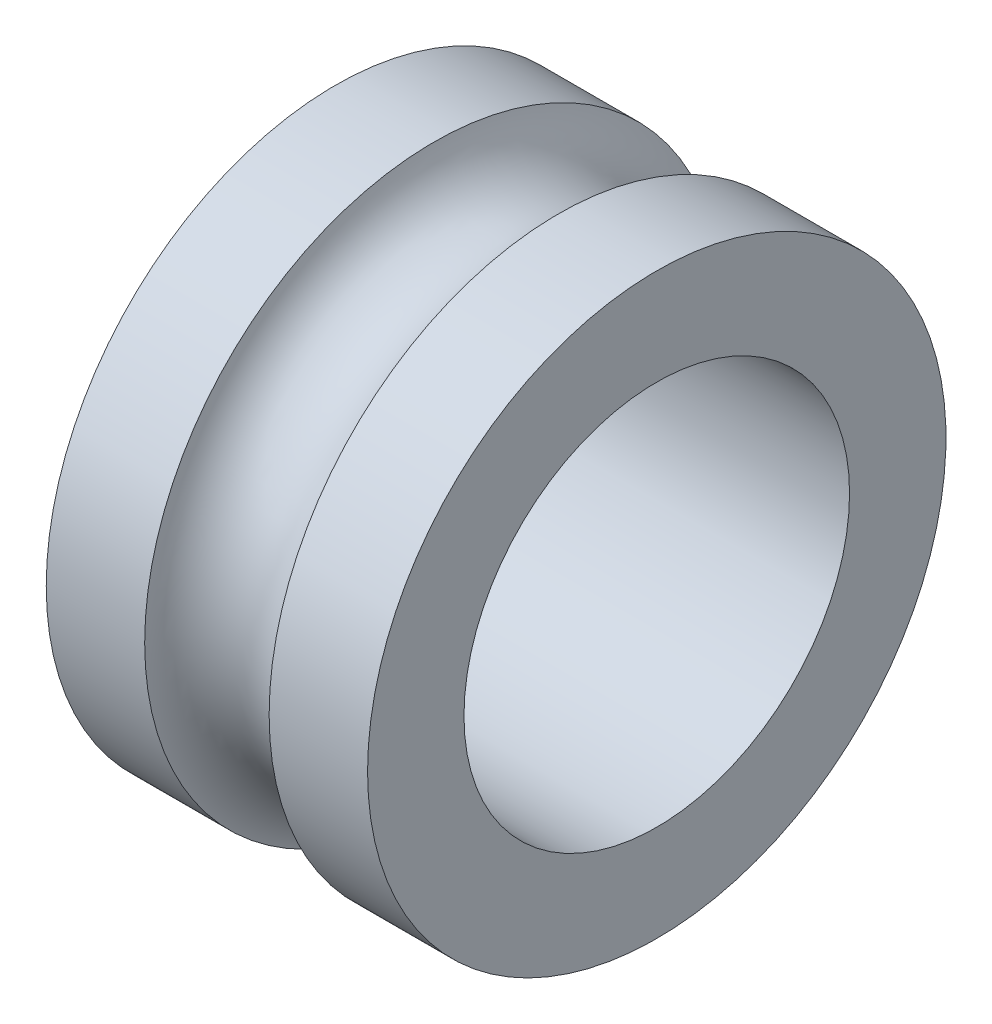
ISO-10303-21;
HEADER;
FILE_DESCRIPTION(('STEP AP214'),'2;1');
FILE_NAME('part.step','',(''),(''),'','','');
FILE_SCHEMA(('AUTOMOTIVE_DESIGN { 1 0 10303 214 1 1 1 1 }'));
ENDSEC;
DATA;
#1=APPLICATION_CONTEXT('core data for automotive mechanical design processes');
#2=APPLICATION_PROTOCOL_DEFINITION('international standard','automotive_design',2000,#1);
#3=PRODUCT_CONTEXT('',#1,'mechanical');
#4=PRODUCT('Part','Part','',(#3));
#5=PRODUCT_RELATED_PRODUCT_CATEGORY('part','',(#4));
#6=PRODUCT_DEFINITION_FORMATION('','',#4);
#7=PRODUCT_DEFINITION_CONTEXT('part definition',#1,'design');
#8=PRODUCT_DEFINITION('design','',#6,#7);
#9=PRODUCT_DEFINITION_SHAPE('','',#8);
#10=(LENGTH_UNIT() NAMED_UNIT(*) SI_UNIT(.MILLI.,.METRE.));
#11=(NAMED_UNIT(*) PLANE_ANGLE_UNIT() SI_UNIT($,.RADIAN.));
#12=(NAMED_UNIT(*) SI_UNIT($,.STERADIAN.) SOLID_ANGLE_UNIT());
#13=UNCERTAINTY_MEASURE_WITH_UNIT(LENGTH_MEASURE(1.E-05),#10,'distance_accuracy_value','');
#14=(GEOMETRIC_REPRESENTATION_CONTEXT(3) GLOBAL_UNCERTAINTY_ASSIGNED_CONTEXT((#13)) GLOBAL_UNIT_ASSIGNED_CONTEXT((#10,
#11,#12)) REPRESENTATION_CONTEXT('',''));
#15=CARTESIAN_POINT('',(0.,0.,0.));
#16=DIRECTION('',(0.,0.,1.));
#17=DIRECTION('',(1.,0.,0.));
#18=AXIS2_PLACEMENT_3D('',#15,#16,#17);
#19=CARTESIAN_POINT('',(-27.4434685173137,-8.792635278647,0.));
#20=DIRECTION('',(-1.,0.,0.));
#21=DIRECTION('',(0.,0.,1.));
#22=AXIS2_PLACEMENT_3D('',#19,#20,#21);
#23=CYLINDRICAL_SURFACE('',#22,4.5);
#24=CARTESIAN_POINT('',(-29.9434685173137,-8.792635278647,0.));
#25=DIRECTION('',(-1.,0.,0.));
#26=DIRECTION('',(0.,0.,1.));
#27=AXIS2_PLACEMENT_3D('',#24,#25,#26);
#28=CIRCLE('',#27,4.5);
#29=CARTESIAN_POINT('',(-29.9434685173137,-8.792635278647,4.5));
#30=VERTEX_POINT('',#29);
#31=EDGE_CURVE('E10',#30,#30,#28,.T.);
#32=ORIENTED_EDGE('',*,*,#31,.F.);
#33=EDGE_LOOP('',(#32));
#34=FACE_BOUND('',#33,.T.);
#35=CARTESIAN_POINT('',(-28.4117143538655,-8.792635278647,0.));
#36=DIRECTION('',(-1.,0.,0.));
#37=DIRECTION('',(0.,0.,1.));
#38=AXIS2_PLACEMENT_3D('',#35,#36,#37);
#39=CIRCLE('',#38,4.5);
#40=CARTESIAN_POINT('',(-28.4117143538655,-8.792635278647,4.5));
#41=VERTEX_POINT('',#40);
#42=EDGE_CURVE('E53',#41,#41,#39,.T.);
#43=ORIENTED_EDGE('',*,*,#42,.T.);
#44=EDGE_LOOP('',(#43));
#45=FACE_BOUND('',#44,.T.);
#46=ADVANCED_FACE('F31',(#34,#45),#23,.T.);
#47=CARTESIAN_POINT('',(-29.9434685173137,-4.292635278647,0.));
#48=DIRECTION('',(1.,0.,0.));
#49=DIRECTION('',(0.,0.,-1.));
#50=AXIS2_PLACEMENT_3D('',#47,#48,#49);
#51=PLANE('',#50);
#52=CARTESIAN_POINT('',(-29.9434685173137,-8.792635278647,0.));
#53=DIRECTION('',(-1.,0.,0.));
#54=DIRECTION('',(0.,0.,1.));
#55=AXIS2_PLACEMENT_3D('',#52,#53,#54);
#56=CIRCLE('',#55,3.);
#57=CARTESIAN_POINT('',(-29.9434685173137,-8.792635278647,3.));
#58=VERTEX_POINT('',#57);
#59=EDGE_CURVE('E37',#58,#58,#56,.T.);
#60=ORIENTED_EDGE('',*,*,#59,.F.);
#61=EDGE_LOOP('',(#60));
#62=FACE_BOUND('',#61,.T.);
#63=ORIENTED_EDGE('',*,*,#31,.T.);
#64=EDGE_LOOP('',(#63));
#65=FACE_BOUND('',#64,.T.);
#66=ADVANCED_FACE('F78',(#62,#65),#51,.F.);
#67=CARTESIAN_POINT('',(-27.4434685173137,-8.792635278647,0.));
#68=DIRECTION('',(-1.,0.,0.));
#69=DIRECTION('',(0.,0.,1.));
#70=AXIS2_PLACEMENT_3D('',#67,#68,#69);
#71=CYLINDRICAL_SURFACE('',#70,3.);
#72=CARTESIAN_POINT('',(-24.9434685173137,-8.792635278647,0.));
#73=DIRECTION('',(-1.,0.,0.));
#74=DIRECTION('',(0.,0.,1.));
#75=AXIS2_PLACEMENT_3D('',#72,#73,#74);
#76=CIRCLE('',#75,3.);
#77=CARTESIAN_POINT('',(-24.9434685173137,-8.792635278647,3.));
#78=VERTEX_POINT('',#77);
#79=EDGE_CURVE('E41',#78,#78,#76,.T.);
#80=ORIENTED_EDGE('',*,*,#79,.F.);
#81=EDGE_LOOP('',(#80));
#82=FACE_BOUND('',#81,.T.);
#83=ORIENTED_EDGE('',*,*,#59,.T.);
#84=EDGE_LOOP('',(#83));
#85=FACE_BOUND('',#84,.T.);
#86=ADVANCED_FACE('F73',(#82,#85),#71,.F.);
#87=CARTESIAN_POINT('',(-24.9434685173137,-4.292635278647,0.));
#88=DIRECTION('',(-1.,0.,0.));
#89=DIRECTION('',(0.,0.,1.));
#90=AXIS2_PLACEMENT_3D('',#87,#88,#89);
#91=PLANE('',#90);
#92=CARTESIAN_POINT('',(-24.9434685173137,-8.792635278647,0.));
#93=DIRECTION('',(-1.,0.,0.));
#94=DIRECTION('',(0.,0.,1.));
#95=AXIS2_PLACEMENT_3D('',#92,#93,#94);
#96=CIRCLE('',#95,4.5);
#97=CARTESIAN_POINT('',(-24.9434685173137,-8.792635278647,4.5));
#98=VERTEX_POINT('',#97);
#99=EDGE_CURVE('E45',#98,#98,#96,.T.);
#100=ORIENTED_EDGE('',*,*,#99,.F.);
#101=EDGE_LOOP('',(#100));
#102=FACE_BOUND('',#101,.T.);
#103=ORIENTED_EDGE('',*,*,#79,.T.);
#104=EDGE_LOOP('',(#103));
#105=FACE_BOUND('',#104,.T.);
#106=ADVANCED_FACE('F67',(#102,#105),#91,.F.);
#107=CARTESIAN_POINT('',(-27.4434685173137,-8.792635278647,0.));
#108=DIRECTION('',(-1.,0.,0.));
#109=DIRECTION('',(0.,0.,1.));
#110=AXIS2_PLACEMENT_3D('',#107,#108,#109);
#111=CYLINDRICAL_SURFACE('',#110,4.5);
#112=CARTESIAN_POINT('',(-26.4752226807618,-8.792635278647,0.));
#113=DIRECTION('',(-1.,0.,0.));
#114=DIRECTION('',(0.,0.,1.));
#115=AXIS2_PLACEMENT_3D('',#112,#113,#114);
#116=CIRCLE('',#115,4.5);
#117=CARTESIAN_POINT('',(-26.4752226807618,-8.792635278647,4.5));
#118=VERTEX_POINT('',#117);
#119=EDGE_CURVE('E50',#118,#118,#116,.T.);
#120=ORIENTED_EDGE('',*,*,#119,.F.);
#121=EDGE_LOOP('',(#120));
#122=FACE_BOUND('',#121,.T.);
#123=ORIENTED_EDGE('',*,*,#99,.T.);
#124=EDGE_LOOP('',(#123));
#125=FACE_BOUND('',#124,.T.);
#126=ADVANCED_FACE('F61',(#122,#125),#111,.T.);
#127=CARTESIAN_POINT('',(-27.4434685173137,-8.792635278647,0.));
#128=DIRECTION('',(-1.,0.,0.));
#129=DIRECTION('',(0.,0.,1.));
#130=AXIS2_PLACEMENT_3D('',#127,#128,#129);
#131=TOROIDAL_SURFACE('',#130,4.75,1.);
#132=ORIENTED_EDGE('',*,*,#42,.F.);
#133=EDGE_LOOP('',(#132));
#134=FACE_BOUND('',#133,.T.);
#135=ORIENTED_EDGE('',*,*,#119,.T.);
#136=EDGE_LOOP('',(#135));
#137=FACE_BOUND('',#136,.T.);
#138=ADVANCED_FACE('F58',(#134,#137),#131,.F.);
#139=CLOSED_SHELL('',(#46,#66,#86,#106,#126,#138));
#140=MANIFOLD_SOLID_BREP('B2',#139);
#141=ADVANCED_BREP_SHAPE_REPRESENTATION('',(#18,#140),#14);
#142=SHAPE_DEFINITION_REPRESENTATION(#9,#141);
ENDSEC;
END-ISO-10303-21;
